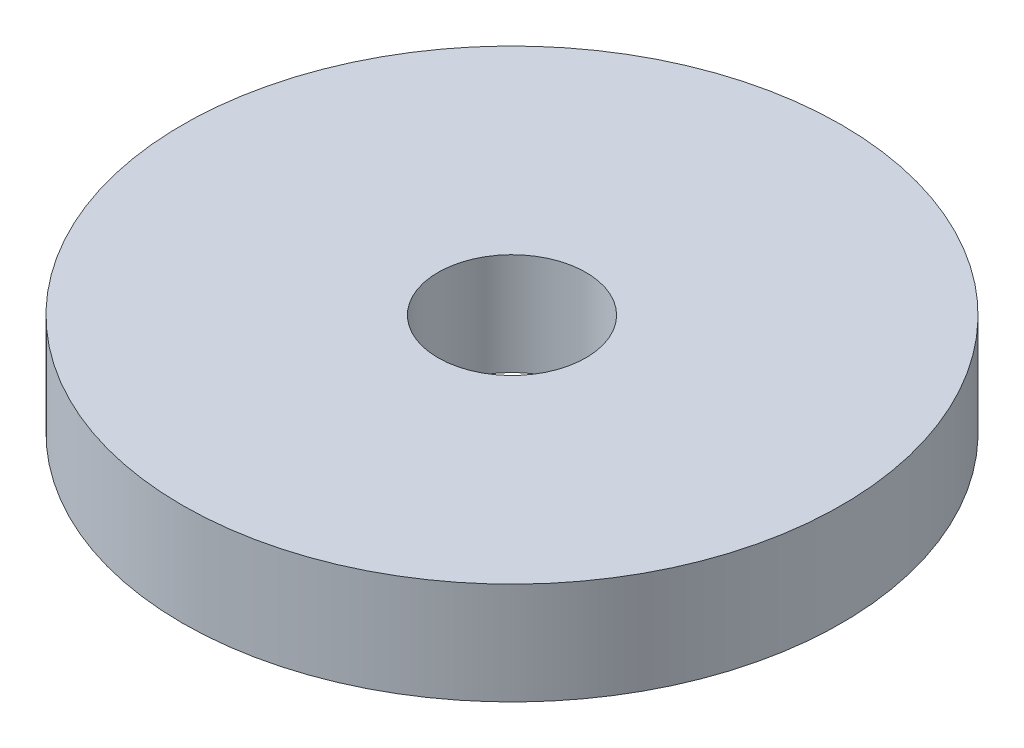
ISO-10303-21;
HEADER;
FILE_DESCRIPTION(('STEP AP214'),'2;1');
FILE_NAME('part.step','',(''),(''),'','','');
FILE_SCHEMA(('AUTOMOTIVE_DESIGN { 1 0 10303 214 1 1 1 1 }'));
ENDSEC;
DATA;
#1=APPLICATION_CONTEXT('core data for automotive mechanical design processes');
#2=APPLICATION_PROTOCOL_DEFINITION('international standard','automotive_design',2000,#1);
#3=PRODUCT_CONTEXT('',#1,'mechanical');
#4=PRODUCT('Part','Part','',(#3));
#5=PRODUCT_RELATED_PRODUCT_CATEGORY('part','',(#4));
#6=PRODUCT_DEFINITION_FORMATION('','',#4);
#7=PRODUCT_DEFINITION_CONTEXT('part definition',#1,'design');
#8=PRODUCT_DEFINITION('design','',#6,#7);
#9=PRODUCT_DEFINITION_SHAPE('','',#8);
#10=(LENGTH_UNIT() NAMED_UNIT(*) SI_UNIT(.MILLI.,.METRE.));
#11=(NAMED_UNIT(*) PLANE_ANGLE_UNIT() SI_UNIT($,.RADIAN.));
#12=(NAMED_UNIT(*) SI_UNIT($,.STERADIAN.) SOLID_ANGLE_UNIT());
#13=UNCERTAINTY_MEASURE_WITH_UNIT(LENGTH_MEASURE(1.E-05),#10,'distance_accuracy_value','');
#14=(GEOMETRIC_REPRESENTATION_CONTEXT(3) GLOBAL_UNCERTAINTY_ASSIGNED_CONTEXT((#13)) GLOBAL_UNIT_ASSIGNED_CONTEXT((#10,
#11,#12)) REPRESENTATION_CONTEXT('',''));
#15=CARTESIAN_POINT('',(0.,0.,0.));
#16=DIRECTION('',(0.,0.,1.));
#17=DIRECTION('',(1.,0.,0.));
#18=AXIS2_PLACEMENT_3D('',#15,#16,#17);
#19=CARTESIAN_POINT('',(0.,7.112,0.));
#20=DIRECTION('',(0.,1.,0.));
#21=DIRECTION('',(0.,0.,1.));
#22=AXIS2_PLACEMENT_3D('',#19,#20,#21);
#23=PLANE('',#22);
#24=CARTESIAN_POINT('',(0.,7.112,0.));
#25=DIRECTION('',(0.,1.,0.));
#26=DIRECTION('',(0.,0.,1.));
#27=AXIS2_PLACEMENT_3D('',#24,#25,#26);
#28=CIRCLE('',#27,22.9704003901048);
#29=CARTESIAN_POINT('',(0.,7.112,22.9704003901048));
#30=VERTEX_POINT('',#29);
#31=EDGE_CURVE('E10',#30,#30,#28,.T.);
#32=ORIENTED_EDGE('',*,*,#31,.T.);
#33=EDGE_LOOP('',(#32));
#34=FACE_BOUND('',#33,.T.);
#35=CARTESIAN_POINT('',(0.,7.112,0.));
#36=DIRECTION('',(0.,1.,0.));
#37=DIRECTION('',(0.,0.,1.));
#38=AXIS2_PLACEMENT_3D('',#35,#36,#37);
#39=CIRCLE('',#38,5.15733811423047);
#40=CARTESIAN_POINT('',(0.,7.112,5.15733811423047));
#41=VERTEX_POINT('',#40);
#42=EDGE_CURVE('E42',#41,#41,#39,.T.);
#43=ORIENTED_EDGE('',*,*,#42,.F.);
#44=EDGE_LOOP('',(#43));
#45=FACE_BOUND('',#44,.T.);
#46=ADVANCED_FACE('F31',(#34,#45),#23,.T.);
#47=CARTESIAN_POINT('',(0.,0.,0.));
#48=DIRECTION('',(0.,1.,0.));
#49=DIRECTION('',(0.,0.,1.));
#50=AXIS2_PLACEMENT_3D('',#47,#48,#49);
#51=PLANE('',#50);
#52=CARTESIAN_POINT('',(0.,0.,0.));
#53=DIRECTION('',(0.,1.,0.));
#54=DIRECTION('',(0.,0.,1.));
#55=AXIS2_PLACEMENT_3D('',#52,#53,#54);
#56=CIRCLE('',#55,22.9704003901048);
#57=CARTESIAN_POINT('',(0.,0.,22.9704003901048));
#58=VERTEX_POINT('',#57);
#59=EDGE_CURVE('E35',#58,#58,#56,.T.);
#60=ORIENTED_EDGE('',*,*,#59,.F.);
#61=EDGE_LOOP('',(#60));
#62=FACE_BOUND('',#61,.T.);
#63=CARTESIAN_POINT('',(0.,0.,0.));
#64=DIRECTION('',(0.,1.,0.));
#65=DIRECTION('',(0.,0.,1.));
#66=AXIS2_PLACEMENT_3D('',#63,#64,#65);
#67=CIRCLE('',#66,5.15733811423047);
#68=CARTESIAN_POINT('',(0.,0.,5.15733811423047));
#69=VERTEX_POINT('',#68);
#70=EDGE_CURVE('E44',#69,#69,#67,.T.);
#71=ORIENTED_EDGE('',*,*,#70,.T.);
#72=EDGE_LOOP('',(#71));
#73=FACE_BOUND('',#72,.T.);
#74=ADVANCED_FACE('F54',(#62,#73),#51,.F.);
#75=CARTESIAN_POINT('',(0.,7.112,0.));
#76=DIRECTION('',(0.,-1.,0.));
#77=DIRECTION('',(0.,0.,-1.));
#78=AXIS2_PLACEMENT_3D('',#75,#76,#77);
#79=CYLINDRICAL_SURFACE('',#78,22.9704003901048);
#80=ORIENTED_EDGE('',*,*,#31,.F.);
#81=EDGE_LOOP('',(#80));
#82=FACE_BOUND('',#81,.T.);
#83=ORIENTED_EDGE('',*,*,#59,.T.);
#84=EDGE_LOOP('',(#83));
#85=FACE_BOUND('',#84,.T.);
#86=ADVANCED_FACE('F33',(#82,#85),#79,.T.);
#87=CARTESIAN_POINT('',(0.,7.112,0.));
#88=DIRECTION('',(0.,-1.,0.));
#89=DIRECTION('',(0.,0.,-1.));
#90=AXIS2_PLACEMENT_3D('',#87,#88,#89);
#91=CYLINDRICAL_SURFACE('',#90,5.15733811423047);
#92=ORIENTED_EDGE('',*,*,#42,.T.);
#93=EDGE_LOOP('',(#92));
#94=FACE_BOUND('',#93,.T.);
#95=ORIENTED_EDGE('',*,*,#70,.F.);
#96=EDGE_LOOP('',(#95));
#97=FACE_BOUND('',#96,.T.);
#98=ADVANCED_FACE('F50',(#94,#97),#91,.F.);
#99=CLOSED_SHELL('',(#46,#74,#86,#98));
#100=MANIFOLD_SOLID_BREP('B2',#99);
#101=ADVANCED_BREP_SHAPE_REPRESENTATION('',(#18,#100),#14);
#102=SHAPE_DEFINITION_REPRESENTATION(#9,#101);
ENDSEC;
END-ISO-10303-21;
